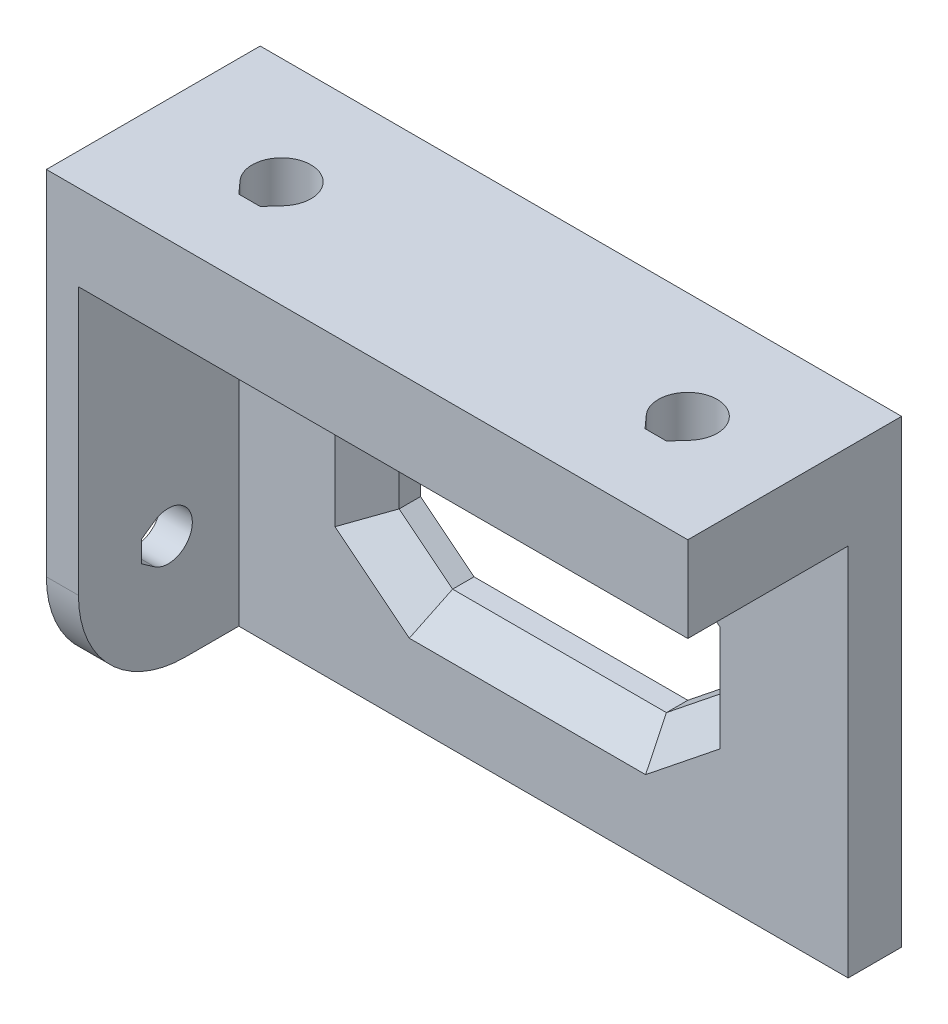
ISO-10303-21;
HEADER;
FILE_DESCRIPTION(('STEP AP214'),'2;1');
FILE_NAME('part.step','',(''),(''),'','','');
FILE_SCHEMA(('AUTOMOTIVE_DESIGN { 1 0 10303 214 1 1 1 1 }'));
ENDSEC;
DATA;
#1=APPLICATION_CONTEXT('core data for automotive mechanical design processes');
#2=APPLICATION_PROTOCOL_DEFINITION('international standard','automotive_design',2000,#1);
#3=PRODUCT_CONTEXT('',#1,'mechanical');
#4=PRODUCT('Part','Part','',(#3));
#5=PRODUCT_RELATED_PRODUCT_CATEGORY('part','',(#4));
#6=PRODUCT_DEFINITION_FORMATION('','',#4);
#7=PRODUCT_DEFINITION_CONTEXT('part definition',#1,'design');
#8=PRODUCT_DEFINITION('design','',#6,#7);
#9=PRODUCT_DEFINITION_SHAPE('','',#8);
#10=(LENGTH_UNIT() NAMED_UNIT(*) SI_UNIT(.MILLI.,.METRE.));
#11=(NAMED_UNIT(*) PLANE_ANGLE_UNIT() SI_UNIT($,.RADIAN.));
#12=(NAMED_UNIT(*) SI_UNIT($,.STERADIAN.) SOLID_ANGLE_UNIT());
#13=UNCERTAINTY_MEASURE_WITH_UNIT(LENGTH_MEASURE(1.E-05),#10,'distance_accuracy_value','');
#14=(GEOMETRIC_REPRESENTATION_CONTEXT(3) GLOBAL_UNCERTAINTY_ASSIGNED_CONTEXT((#13)) GLOBAL_UNIT_ASSIGNED_CONTEXT((#10,
#11,#12)) REPRESENTATION_CONTEXT('',''));
#15=CARTESIAN_POINT('',(0.,0.,0.));
#16=DIRECTION('',(0.,0.,1.));
#17=DIRECTION('',(1.,0.,0.));
#18=AXIS2_PLACEMENT_3D('',#15,#16,#17);
#19=CARTESIAN_POINT('',(0.,0.,5.));
#20=DIRECTION('',(0.,0.,-1.));
#21=DIRECTION('',(-1.,0.,0.));
#22=AXIS2_PLACEMENT_3D('',#19,#20,#21);
#23=PLANE('',#22);
#24=DIRECTION('',(-1.,0.,0.));
#25=VECTOR('',#24,1.);
#26=CARTESIAN_POINT('',(20.,7.,5.));
#27=LINE('',#26,#25);
#28=CARTESIAN_POINT('',(41.0523431780747,7.,5.));
#29=VERTEX_POINT('',#28);
#30=CARTESIAN_POINT('',(18.9476568219253,7.,5.));
#31=VERTEX_POINT('',#30);
#32=EDGE_CURVE('E584',#29,#31,#27,.T.);
#33=ORIENTED_EDGE('',*,*,#32,.T.);
#34=DIRECTION('',(-0.780868809443029,0.624695047554425,0.));
#35=VECTOR('',#34,1.);
#36=CARTESIAN_POINT('',(10.808841686605,13.5110521082563,5.));
#37=LINE('',#36,#35);
#38=CARTESIAN_POINT('',(12.,12.5581254575403,5.));
#39=VERTEX_POINT('',#38);
#40=EDGE_CURVE('E581',#31,#39,#37,.T.);
#41=ORIENTED_EDGE('',*,*,#40,.T.);
#42=DIRECTION('',(0.,1.,0.));
#43=VECTOR('',#42,1.);
#44=CARTESIAN_POINT('',(12.,21.,5.));
#45=LINE('',#44,#43);
#46=CARTESIAN_POINT('',(12.,22.4418745424597,5.));
#47=VERTEX_POINT('',#46);
#48=EDGE_CURVE('E593',#39,#47,#45,.T.);
#49=ORIENTED_EDGE('',*,*,#48,.T.);
#50=DIRECTION('',(0.78086880944303,0.624695047554425,0.));
#51=VECTOR('',#50,1.);
#52=CARTESIAN_POINT('',(-6.2643290451023,7.83041130637787,5.));
#53=LINE('',#52,#51);
#54=CARTESIAN_POINT('',(18.9476568219254,28.,5.));
#55=VERTEX_POINT('',#54);
#56=EDGE_CURVE('E591',#47,#55,#53,.T.);
#57=ORIENTED_EDGE('',*,*,#56,.T.);
#58=DIRECTION('',(1.,0.,0.));
#59=VECTOR('',#58,1.);
#60=CARTESIAN_POINT('',(40.,28.,5.));
#61=LINE('',#60,#59);
#62=CARTESIAN_POINT('',(41.0523431780747,28.,5.));
#63=VERTEX_POINT('',#62);
#64=EDGE_CURVE('E589',#55,#63,#61,.T.);
#65=ORIENTED_EDGE('',*,*,#64,.T.);
#66=DIRECTION('',(0.78086880944303,-0.624695047554425,0.));
#67=VECTOR('',#66,1.);
#68=CARTESIAN_POINT('',(29.6789631914438,37.0987039893047,5.));
#69=LINE('',#68,#67);
#70=CARTESIAN_POINT('',(48.,22.4418745424597,5.));
#71=VERTEX_POINT('',#70);
#72=EDGE_CURVE('E532',#63,#71,#69,.T.);
#73=ORIENTED_EDGE('',*,*,#72,.T.);
#74=DIRECTION('',(0.,-1.,0.));
#75=VECTOR('',#74,1.);
#76=CARTESIAN_POINT('',(48.,14.,5.));
#77=LINE('',#76,#75);
#78=CARTESIAN_POINT('',(48.,12.5581254575403,5.));
#79=VERTEX_POINT('',#78);
#80=EDGE_CURVE('E570',#71,#79,#77,.T.);
#81=ORIENTED_EDGE('',*,*,#80,.T.);
#82=DIRECTION('',(-0.78086880944303,-0.624695047554425,0.));
#83=VECTOR('',#82,1.);
#84=CARTESIAN_POINT('',(12.6057924597365,-15.7572405746706,5.));
#85=LINE('',#84,#83);
#86=EDGE_CURVE('E567',#79,#29,#85,.T.);
#87=ORIENTED_EDGE('',*,*,#86,.T.);
#88=EDGE_LOOP('',(#33,#41,#49,#57,#65,#73,#81,#87));
#89=FACE_BOUND('',#88,.T.);
#90=DIRECTION('',(0.,1.,0.));
#91=VECTOR('',#90,1.);
#92=CARTESIAN_POINT('',(3.,35.,5.));
#93=LINE('',#92,#91);
#94=CARTESIAN_POINT('',(3.,0.,5.));
#95=VERTEX_POINT('',#94);
#96=CARTESIAN_POINT('',(3.,35.,5.));
#97=VERTEX_POINT('',#96);
#98=EDGE_CURVE('E275',#95,#97,#93,.T.);
#99=ORIENTED_EDGE('',*,*,#98,.F.);
#100=DIRECTION('',(1.,0.,0.));
#101=VECTOR('',#100,1.);
#102=CARTESIAN_POINT('',(0.,0.,5.));
#103=LINE('',#102,#101);
#104=CARTESIAN_POINT('',(60.,0.,5.));
#105=VERTEX_POINT('',#104);
#106=EDGE_CURVE('E387',#95,#105,#103,.T.);
#107=ORIENTED_EDGE('',*,*,#106,.T.);
#108=DIRECTION('',(0.,1.,0.));
#109=VECTOR('',#108,1.);
#110=CARTESIAN_POINT('',(60.,0.,5.));
#111=LINE('',#110,#109);
#112=CARTESIAN_POINT('',(60.,35.,5.));
#113=VERTEX_POINT('',#112);
#114=EDGE_CURVE('E389',#105,#113,#111,.T.);
#115=ORIENTED_EDGE('',*,*,#114,.T.);
#116=DIRECTION('',(-1.,0.,0.));
#117=VECTOR('',#116,1.);
#118=CARTESIAN_POINT('',(0.,35.,5.));
#119=LINE('',#118,#117);
#120=EDGE_CURVE('E395',#113,#97,#119,.T.);
#121=ORIENTED_EDGE('',*,*,#120,.T.);
#122=EDGE_LOOP('',(#99,#107,#115,#121));
#123=FACE_BOUND('',#122,.T.);
#124=ADVANCED_FACE('F32',(#89,#123),#23,.F.);
#125=CARTESIAN_POINT('',(60.,35.,20.));
#126=DIRECTION('',(0.,-1.,0.));
#127=DIRECTION('',(0.,0.,-1.));
#128=AXIS2_PLACEMENT_3D('',#125,#126,#127);
#129=PLANE('',#128);
#130=CARTESIAN_POINT('',(12.,35.,10.));
#131=DIRECTION('',(0.,-1.,0.));
#132=DIRECTION('',(0.,0.,-1.));
#133=AXIS2_PLACEMENT_3D('',#130,#131,#132);
#134=CIRCLE('',#133,2.75);
#135=CARTESIAN_POINT('',(9.95571916283033,35.,11.8394063876101));
#136=VERTEX_POINT('',#135);
#137=CARTESIAN_POINT('',(14.0442808371697,35.,11.8394063876101));
#138=VERTEX_POINT('',#137);
#139=EDGE_CURVE('E309',#136,#138,#134,.T.);
#140=ORIENTED_EDGE('',*,*,#139,.F.);
#141=DIRECTION('',(-0.668875050040038,0.,-0.743374849879882));
#142=VECTOR('',#141,1.);
#143=CARTESIAN_POINT('',(9.95571916283033,35.,11.8394063876101));
#144=LINE('',#143,#142);
#145=CARTESIAN_POINT('',(11.,35.,13.));
#146=VERTEX_POINT('',#145);
#147=EDGE_CURVE('E320',#146,#136,#144,.T.);
#148=ORIENTED_EDGE('',*,*,#147,.F.);
#149=DIRECTION('',(-1.,0.,0.));
#150=VECTOR('',#149,1.);
#151=CARTESIAN_POINT('',(11.,35.,13.));
#152=LINE('',#151,#150);
#153=CARTESIAN_POINT('',(13.,35.,13.));
#154=VERTEX_POINT('',#153);
#155=EDGE_CURVE('E334',#154,#146,#152,.T.);
#156=ORIENTED_EDGE('',*,*,#155,.F.);
#157=DIRECTION('',(-0.668875050040038,0.,0.743374849879882));
#158=VECTOR('',#157,1.);
#159=CARTESIAN_POINT('',(13.,35.,13.));
#160=LINE('',#159,#158);
#161=EDGE_CURVE('E331',#138,#154,#160,.T.);
#162=ORIENTED_EDGE('',*,*,#161,.F.);
#163=EDGE_LOOP('',(#140,#148,#156,#162));
#164=FACE_BOUND('',#163,.T.);
#165=CARTESIAN_POINT('',(50.,35.,10.));
#166=DIRECTION('',(0.,-1.,0.));
#167=DIRECTION('',(0.,0.,-1.));
#168=AXIS2_PLACEMENT_3D('',#165,#166,#167);
#169=CIRCLE('',#168,2.75);
#170=CARTESIAN_POINT('',(47.9557191628303,35.,11.8394063876101));
#171=VERTEX_POINT('',#170);
#172=CARTESIAN_POINT('',(52.0442808371697,35.,11.8394063876101));
#173=VERTEX_POINT('',#172);
#174=EDGE_CURVE('E281',#171,#173,#169,.T.);
#175=ORIENTED_EDGE('',*,*,#174,.F.);
#176=DIRECTION('',(-0.668875050040038,0.,-0.743374849879882));
#177=VECTOR('',#176,1.);
#178=CARTESIAN_POINT('',(47.9557191628303,35.,11.8394063876101));
#179=LINE('',#178,#177);
#180=CARTESIAN_POINT('',(49.,35.,13.));
#181=VERTEX_POINT('',#180);
#182=EDGE_CURVE('E288',#181,#171,#179,.T.);
#183=ORIENTED_EDGE('',*,*,#182,.F.);
#184=DIRECTION('',(-1.,0.,0.));
#185=VECTOR('',#184,1.);
#186=CARTESIAN_POINT('',(49.,35.,13.));
#187=LINE('',#186,#185);
#188=CARTESIAN_POINT('',(51.,35.,13.));
#189=VERTEX_POINT('',#188);
#190=EDGE_CURVE('E302',#189,#181,#187,.T.);
#191=ORIENTED_EDGE('',*,*,#190,.F.);
#192=DIRECTION('',(-0.668875050040038,0.,0.743374849879881));
#193=VECTOR('',#192,1.);
#194=CARTESIAN_POINT('',(51.,35.,13.));
#195=LINE('',#194,#193);
#196=EDGE_CURVE('E299',#173,#189,#195,.T.);
#197=ORIENTED_EDGE('',*,*,#196,.F.);
#198=EDGE_LOOP('',(#175,#183,#191,#197));
#199=FACE_BOUND('',#198,.T.);
#200=DIRECTION('',(-1.,0.,0.));
#201=VECTOR('',#200,1.);
#202=CARTESIAN_POINT('',(60.,35.,20.));
#203=LINE('',#202,#201);
#204=CARTESIAN_POINT('',(60.,35.,20.));
#205=VERTEX_POINT('',#204);
#206=CARTESIAN_POINT('',(3.,35.,20.));
#207=VERTEX_POINT('',#206);
#208=EDGE_CURVE('E351',#205,#207,#203,.T.);
#209=ORIENTED_EDGE('',*,*,#208,.T.);
#210=DIRECTION('',(0.,0.,-1.));
#211=VECTOR('',#210,1.);
#212=CARTESIAN_POINT('',(3.,35.,55.1283361405006));
#213=LINE('',#212,#211);
#214=EDGE_CURVE('E278',#207,#97,#213,.T.);
#215=ORIENTED_EDGE('',*,*,#214,.T.);
#216=ORIENTED_EDGE('',*,*,#120,.F.);
#217=DIRECTION('',(0.,0.,-1.));
#218=VECTOR('',#217,1.);
#219=CARTESIAN_POINT('',(60.,35.,20.));
#220=LINE('',#219,#218);
#221=EDGE_CURVE('E359',#205,#113,#220,.T.);
#222=ORIENTED_EDGE('',*,*,#221,.F.);
#223=EDGE_LOOP('',(#209,#215,#216,#222));
#224=FACE_BOUND('',#223,.T.);
#225=ADVANCED_FACE('F430',(#164,#199,#224),#129,.T.);
#226=CARTESIAN_POINT('',(0.,0.,0.));
#227=DIRECTION('',(0.,0.,-1.));
#228=DIRECTION('',(-1.,0.,0.));
#229=AXIS2_PLACEMENT_3D('',#226,#227,#228);
#230=PLANE('',#229);
#231=DIRECTION('',(0.,-1.,0.));
#232=VECTOR('',#231,1.);
#233=CARTESIAN_POINT('',(0.,0.,0.));
#234=LINE('',#233,#232);
#235=CARTESIAN_POINT('',(0.,43.,0.));
#236=VERTEX_POINT('',#235);
#237=CARTESIAN_POINT('',(0.,0.,0.));
#238=VERTEX_POINT('',#237);
#239=EDGE_CURVE('E386',#236,#238,#234,.T.);
#240=ORIENTED_EDGE('',*,*,#239,.F.);
#241=DIRECTION('',(1.,0.,0.));
#242=VECTOR('',#241,1.);
#243=CARTESIAN_POINT('',(60.,43.,0.));
#244=LINE('',#243,#242);
#245=CARTESIAN_POINT('',(60.,43.,0.));
#246=VERTEX_POINT('',#245);
#247=EDGE_CURVE('E341',#236,#246,#244,.T.);
#248=ORIENTED_EDGE('',*,*,#247,.T.);
#249=DIRECTION('',(0.,1.,0.));
#250=VECTOR('',#249,1.);
#251=CARTESIAN_POINT('',(60.,0.,0.));
#252=LINE('',#251,#250);
#253=CARTESIAN_POINT('',(60.,0.,0.));
#254=VERTEX_POINT('',#253);
#255=EDGE_CURVE('E390',#254,#246,#252,.T.);
#256=ORIENTED_EDGE('',*,*,#255,.F.);
#257=DIRECTION('',(1.,0.,0.));
#258=VECTOR('',#257,1.);
#259=CARTESIAN_POINT('',(0.,0.,0.));
#260=LINE('',#259,#258);
#261=EDGE_CURVE('E623',#238,#254,#260,.T.);
#262=ORIENTED_EDGE('',*,*,#261,.F.);
#263=EDGE_LOOP('',(#240,#248,#256,#262));
#264=FACE_BOUND('',#263,.T.);
#265=DIRECTION('',(0.,1.,0.));
#266=VECTOR('',#265,1.);
#267=CARTESIAN_POINT('',(45.,25.,0.));
#268=LINE('',#267,#266);
#269=CARTESIAN_POINT('',(45.,14.,0.));
#270=VERTEX_POINT('',#269);
#271=CARTESIAN_POINT('',(45.,21.,0.));
#272=VERTEX_POINT('',#271);
#273=EDGE_CURVE('E380',#270,#272,#268,.T.);
#274=ORIENTED_EDGE('',*,*,#273,.T.);
#275=DIRECTION('',(0.78086880944303,-0.624695047554425,0.));
#276=VECTOR('',#275,1.);
#277=CARTESIAN_POINT('',(45.,21.,0.));
#278=LINE('',#277,#276);
#279=CARTESIAN_POINT('',(40.,25.,0.));
#280=VERTEX_POINT('',#279);
#281=EDGE_CURVE('E597',#272,#280,#278,.F.);
#282=ORIENTED_EDGE('',*,*,#281,.T.);
#283=DIRECTION('',(-1.,0.,0.));
#284=VECTOR('',#283,1.);
#285=CARTESIAN_POINT('',(15.,25.,0.));
#286=LINE('',#285,#284);
#287=CARTESIAN_POINT('',(20.,25.,0.));
#288=VERTEX_POINT('',#287);
#289=EDGE_CURVE('E383',#280,#288,#286,.T.);
#290=ORIENTED_EDGE('',*,*,#289,.T.);
#291=DIRECTION('',(0.78086880944303,0.624695047554425,0.));
#292=VECTOR('',#291,1.);
#293=CARTESIAN_POINT('',(20.,25.,0.));
#294=LINE('',#293,#292);
#295=CARTESIAN_POINT('',(15.,21.,0.));
#296=VERTEX_POINT('',#295);
#297=EDGE_CURVE('E608',#288,#296,#294,.F.);
#298=ORIENTED_EDGE('',*,*,#297,.T.);
#299=DIRECTION('',(0.,-1.,0.));
#300=VECTOR('',#299,1.);
#301=CARTESIAN_POINT('',(15.,25.,0.));
#302=LINE('',#301,#300);
#303=CARTESIAN_POINT('',(15.,14.,0.));
#304=VERTEX_POINT('',#303);
#305=EDGE_CURVE('E373',#296,#304,#302,.T.);
#306=ORIENTED_EDGE('',*,*,#305,.T.);
#307=DIRECTION('',(-0.780868809443029,0.624695047554425,0.));
#308=VECTOR('',#307,1.);
#309=CARTESIAN_POINT('',(15.,14.,0.));
#310=LINE('',#309,#308);
#311=CARTESIAN_POINT('',(20.,10.,0.));
#312=VERTEX_POINT('',#311);
#313=EDGE_CURVE('E595',#304,#312,#310,.F.);
#314=ORIENTED_EDGE('',*,*,#313,.T.);
#315=DIRECTION('',(1.,0.,0.));
#316=VECTOR('',#315,1.);
#317=CARTESIAN_POINT('',(15.,10.,0.));
#318=LINE('',#317,#316);
#319=CARTESIAN_POINT('',(40.,10.,0.));
#320=VERTEX_POINT('',#319);
#321=EDGE_CURVE('E376',#312,#320,#318,.T.);
#322=ORIENTED_EDGE('',*,*,#321,.T.);
#323=DIRECTION('',(-0.78086880944303,-0.624695047554425,0.));
#324=VECTOR('',#323,1.);
#325=CARTESIAN_POINT('',(40.,10.,0.));
#326=LINE('',#325,#324);
#327=EDGE_CURVE('E610',#320,#270,#326,.F.);
#328=ORIENTED_EDGE('',*,*,#327,.T.);
#329=EDGE_LOOP('',(#274,#282,#290,#298,#306,#314,#322,#328));
#330=FACE_BOUND('',#329,.T.);
#331=ADVANCED_FACE('F457',(#264,#330),#230,.T.);
#332=CARTESIAN_POINT('',(0.,0.,5.));
#333=DIRECTION('',(1.,0.,0.));
#334=DIRECTION('',(0.,0.,-1.));
#335=AXIS2_PLACEMENT_3D('',#332,#333,#334);
#336=PLANE('',#335);
#337=DIRECTION('',(0.,0.571859317824151,0.820351705439622));
#338=VECTOR('',#337,1.);
#339=CARTESIAN_POINT('',(0.,9.6,14.1));
#340=LINE('',#339,#338);
#341=CARTESIAN_POINT('',(0.,8.75420866276086,12.8866834651043));
#342=VERTEX_POINT('',#341);
#343=CARTESIAN_POINT('',(0.,9.6,14.1));
#344=VERTEX_POINT('',#343);
#345=EDGE_CURVE('E255',#342,#344,#340,.T.);
#346=ORIENTED_EDGE('',*,*,#345,.F.);
#347=CARTESIAN_POINT('',(0.,10.6,11.6));
#348=DIRECTION('',(-1.,0.,0.));
#349=DIRECTION('',(0.,0.,1.));
#350=AXIS2_PLACEMENT_3D('',#347,#348,#349);
#351=CIRCLE('',#350,2.25);
#352=CARTESIAN_POINT('',(0.,12.4457913372392,12.8866834651043));
#353=VERTEX_POINT('',#352);
#354=EDGE_CURVE('E260',#353,#342,#351,.T.);
#355=ORIENTED_EDGE('',*,*,#354,.F.);
#356=DIRECTION('',(0.,0.571859317824151,-0.820351705439622));
#357=VECTOR('',#356,1.);
#358=CARTESIAN_POINT('',(0.,12.4457913372392,12.8866834651043));
#359=LINE('',#358,#357);
#360=CARTESIAN_POINT('',(0.,11.6,14.1));
#361=VERTEX_POINT('',#360);
#362=EDGE_CURVE('E265',#361,#353,#359,.T.);
#363=ORIENTED_EDGE('',*,*,#362,.F.);
#364=DIRECTION('',(0.,1.,0.));
#365=VECTOR('',#364,1.);
#366=CARTESIAN_POINT('',(0.,11.6,14.1));
#367=LINE('',#366,#365);
#368=EDGE_CURVE('E244',#344,#361,#367,.T.);
#369=ORIENTED_EDGE('',*,*,#368,.F.);
#370=EDGE_LOOP('',(#346,#355,#363,#369));
#371=FACE_BOUND('',#370,.T.);
#372=DIRECTION('',(0.,0.,-1.));
#373=VECTOR('',#372,1.);
#374=CARTESIAN_POINT('',(0.,0.,5.));
#375=LINE('',#374,#373);
#376=CARTESIAN_POINT('',(0.,0.,10.));
#377=VERTEX_POINT('',#376);
#378=EDGE_CURVE('E445',#377,#238,#375,.T.);
#379=ORIENTED_EDGE('',*,*,#378,.F.);
#380=CARTESIAN_POINT('',(0.,10.,10.));
#381=DIRECTION('',(1.,0.,0.));
#382=DIRECTION('',(0.,0.,-1.));
#383=AXIS2_PLACEMENT_3D('',#380,#381,#382);
#384=CIRCLE('',#383,10.);
#385=CARTESIAN_POINT('',(0.,10.,20.));
#386=VERTEX_POINT('',#385);
#387=EDGE_CURVE('E11',#377,#386,#384,.F.);
#388=ORIENTED_EDGE('',*,*,#387,.T.);
#389=DIRECTION('',(0.,1.,0.));
#390=VECTOR('',#389,1.);
#391=CARTESIAN_POINT('',(0.,35.,20.));
#392=LINE('',#391,#390);
#393=CARTESIAN_POINT('',(0.,43.,20.));
#394=VERTEX_POINT('',#393);
#395=EDGE_CURVE('E354',#386,#394,#392,.T.);
#396=ORIENTED_EDGE('',*,*,#395,.T.);
#397=DIRECTION('',(0.,0.,-1.));
#398=VECTOR('',#397,1.);
#399=CARTESIAN_POINT('',(0.,43.,20.));
#400=LINE('',#399,#398);
#401=EDGE_CURVE('E366',#394,#236,#400,.T.);
#402=ORIENTED_EDGE('',*,*,#401,.T.);
#403=ORIENTED_EDGE('',*,*,#239,.T.);
#404=EDGE_LOOP('',(#379,#388,#396,#402,#403));
#405=FACE_BOUND('',#404,.T.);
#406=ADVANCED_FACE('F262',(#371,#405),#336,.F.);
#407=CARTESIAN_POINT('',(0.,0.,5.));
#408=DIRECTION('',(0.,1.,0.));
#409=DIRECTION('',(0.,0.,1.));
#410=AXIS2_PLACEMENT_3D('',#407,#408,#409);
#411=PLANE('',#410);
#412=DIRECTION('',(0.,0.,-1.));
#413=VECTOR('',#412,1.);
#414=CARTESIAN_POINT('',(3.,0.,55.1283361405006));
#415=LINE('',#414,#413);
#416=CARTESIAN_POINT('',(3.,0.,10.));
#417=VERTEX_POINT('',#416);
#418=EDGE_CURVE('E272',#417,#95,#415,.T.);
#419=ORIENTED_EDGE('',*,*,#418,.F.);
#420=DIRECTION('',(1.,0.,0.));
#421=VECTOR('',#420,1.);
#422=CARTESIAN_POINT('',(0.,0.,10.));
#423=LINE('',#422,#421);
#424=EDGE_CURVE('E40',#417,#377,#423,.F.);
#425=ORIENTED_EDGE('',*,*,#424,.T.);
#426=ORIENTED_EDGE('',*,*,#378,.T.);
#427=ORIENTED_EDGE('',*,*,#261,.T.);
#428=DIRECTION('',(0.,0.,-1.));
#429=VECTOR('',#428,1.);
#430=CARTESIAN_POINT('',(60.,0.,5.));
#431=LINE('',#430,#429);
#432=EDGE_CURVE('E399',#105,#254,#431,.T.);
#433=ORIENTED_EDGE('',*,*,#432,.F.);
#434=ORIENTED_EDGE('',*,*,#106,.F.);
#435=EDGE_LOOP('',(#419,#425,#426,#427,#433,#434));
#436=FACE_BOUND('',#435,.T.);
#437=ADVANCED_FACE('F469',(#436),#411,.F.);
#438=CARTESIAN_POINT('',(60.,0.,5.));
#439=DIRECTION('',(-1.,0.,0.));
#440=DIRECTION('',(0.,0.,1.));
#441=AXIS2_PLACEMENT_3D('',#438,#439,#440);
#442=PLANE('',#441);
#443=ORIENTED_EDGE('',*,*,#255,.T.);
#444=DIRECTION('',(0.,0.,-1.));
#445=VECTOR('',#444,1.);
#446=CARTESIAN_POINT('',(60.,43.,20.));
#447=LINE('',#446,#445);
#448=CARTESIAN_POINT('',(60.,43.,20.));
#449=VERTEX_POINT('',#448);
#450=EDGE_CURVE('E362',#449,#246,#447,.T.);
#451=ORIENTED_EDGE('',*,*,#450,.F.);
#452=DIRECTION('',(0.,-1.,0.));
#453=VECTOR('',#452,1.);
#454=CARTESIAN_POINT('',(60.,35.,20.));
#455=LINE('',#454,#453);
#456=EDGE_CURVE('E348',#449,#205,#455,.T.);
#457=ORIENTED_EDGE('',*,*,#456,.T.);
#458=ORIENTED_EDGE('',*,*,#221,.T.);
#459=ORIENTED_EDGE('',*,*,#114,.F.);
#460=ORIENTED_EDGE('',*,*,#432,.T.);
#461=EDGE_LOOP('',(#443,#451,#457,#458,#459,#460));
#462=FACE_BOUND('',#461,.T.);
#463=ADVANCED_FACE('F437',(#462),#442,.F.);
#464=CARTESIAN_POINT('',(15.,25.,5.));
#465=DIRECTION('',(1.,0.,0.));
#466=DIRECTION('',(0.,1.,0.));
#467=AXIS2_PLACEMENT_3D('',#464,#465,#466);
#468=PLANE('',#467);
#469=DIRECTION('',(0.,0.,1.));
#470=VECTOR('',#469,1.);
#471=CARTESIAN_POINT('',(15.,21.,5.));
#472=LINE('',#471,#470);
#473=CARTESIAN_POINT('',(15.,21.,2.));
#474=VERTEX_POINT('',#473);
#475=EDGE_CURVE('E612',#296,#474,#472,.T.);
#476=ORIENTED_EDGE('',*,*,#475,.T.);
#477=DIRECTION('',(0.,-1.,0.));
#478=VECTOR('',#477,1.);
#479=CARTESIAN_POINT('',(15.,14.,2.));
#480=LINE('',#479,#478);
#481=CARTESIAN_POINT('',(15.,14.,2.));
#482=VERTEX_POINT('',#481);
#483=EDGE_CURVE('E407',#474,#482,#480,.T.);
#484=ORIENTED_EDGE('',*,*,#483,.T.);
#485=DIRECTION('',(0.,0.,-1.));
#486=VECTOR('',#485,1.);
#487=CARTESIAN_POINT('',(15.,14.,0.));
#488=LINE('',#487,#486);
#489=EDGE_CURVE('E602',#482,#304,#488,.T.);
#490=ORIENTED_EDGE('',*,*,#489,.T.);
#491=ORIENTED_EDGE('',*,*,#305,.F.);
#492=EDGE_LOOP('',(#476,#484,#490,#491));
#493=FACE_BOUND('',#492,.T.);
#494=ADVANCED_FACE('F462',(#493),#468,.T.);
#495=CARTESIAN_POINT('',(15.,10.,5.));
#496=DIRECTION('',(0.,1.,0.));
#497=DIRECTION('',(-1.,0.,0.));
#498=AXIS2_PLACEMENT_3D('',#495,#496,#497);
#499=PLANE('',#498);
#500=DIRECTION('',(0.,0.,1.));
#501=VECTOR('',#500,1.);
#502=CARTESIAN_POINT('',(20.,10.,5.));
#503=LINE('',#502,#501);
#504=CARTESIAN_POINT('',(20.,10.,2.));
#505=VERTEX_POINT('',#504);
#506=EDGE_CURVE('E599',#312,#505,#503,.T.);
#507=ORIENTED_EDGE('',*,*,#506,.T.);
#508=DIRECTION('',(1.,0.,0.));
#509=VECTOR('',#508,1.);
#510=CARTESIAN_POINT('',(40.,10.,2.));
#511=LINE('',#510,#509);
#512=CARTESIAN_POINT('',(40.,10.,2.));
#513=VERTEX_POINT('',#512);
#514=EDGE_CURVE('E574',#505,#513,#511,.T.);
#515=ORIENTED_EDGE('',*,*,#514,.T.);
#516=DIRECTION('',(0.,0.,-1.));
#517=VECTOR('',#516,1.);
#518=CARTESIAN_POINT('',(40.,10.,0.));
#519=LINE('',#518,#517);
#520=EDGE_CURVE('E619',#513,#320,#519,.T.);
#521=ORIENTED_EDGE('',*,*,#520,.T.);
#522=ORIENTED_EDGE('',*,*,#321,.F.);
#523=EDGE_LOOP('',(#507,#515,#521,#522));
#524=FACE_BOUND('',#523,.T.);
#525=ADVANCED_FACE('F635',(#524),#499,.T.);
#526=CARTESIAN_POINT('',(45.,25.,5.));
#527=DIRECTION('',(-1.,0.,0.));
#528=DIRECTION('',(0.,-1.,0.));
#529=AXIS2_PLACEMENT_3D('',#526,#527,#528);
#530=PLANE('',#529);
#531=DIRECTION('',(0.,0.,1.));
#532=VECTOR('',#531,1.);
#533=CARTESIAN_POINT('',(45.,14.,5.));
#534=LINE('',#533,#532);
#535=CARTESIAN_POINT('',(45.,14.,2.));
#536=VERTEX_POINT('',#535);
#537=EDGE_CURVE('E617',#270,#536,#534,.T.);
#538=ORIENTED_EDGE('',*,*,#537,.T.);
#539=DIRECTION('',(0.,1.,0.));
#540=VECTOR('',#539,1.);
#541=CARTESIAN_POINT('',(45.,21.,2.));
#542=LINE('',#541,#540);
#543=CARTESIAN_POINT('',(45.,21.,2.));
#544=VERTEX_POINT('',#543);
#545=EDGE_CURVE('E546',#536,#544,#542,.T.);
#546=ORIENTED_EDGE('',*,*,#545,.T.);
#547=DIRECTION('',(0.,0.,-1.));
#548=VECTOR('',#547,1.);
#549=CARTESIAN_POINT('',(45.,21.,0.));
#550=LINE('',#549,#548);
#551=EDGE_CURVE('E606',#544,#272,#550,.T.);
#552=ORIENTED_EDGE('',*,*,#551,.T.);
#553=ORIENTED_EDGE('',*,*,#273,.F.);
#554=EDGE_LOOP('',(#538,#546,#552,#553));
#555=FACE_BOUND('',#554,.T.);
#556=ADVANCED_FACE('F631',(#555),#530,.T.);
#557=CARTESIAN_POINT('',(15.,25.,5.));
#558=DIRECTION('',(0.,-1.,0.));
#559=DIRECTION('',(0.,0.,-1.));
#560=AXIS2_PLACEMENT_3D('',#557,#558,#559);
#561=PLANE('',#560);
#562=DIRECTION('',(0.,0.,1.));
#563=VECTOR('',#562,1.);
#564=CARTESIAN_POINT('',(40.,25.,5.));
#565=LINE('',#564,#563);
#566=CARTESIAN_POINT('',(40.,25.,2.));
#567=VERTEX_POINT('',#566);
#568=EDGE_CURVE('E604',#280,#567,#565,.T.);
#569=ORIENTED_EDGE('',*,*,#568,.T.);
#570=DIRECTION('',(-1.,0.,0.));
#571=VECTOR('',#570,1.);
#572=CARTESIAN_POINT('',(20.,25.,2.));
#573=LINE('',#572,#571);
#574=CARTESIAN_POINT('',(20.,25.,2.));
#575=VERTEX_POINT('',#574);
#576=EDGE_CURVE('E536',#567,#575,#573,.T.);
#577=ORIENTED_EDGE('',*,*,#576,.T.);
#578=DIRECTION('',(0.,0.,-1.));
#579=VECTOR('',#578,1.);
#580=CARTESIAN_POINT('',(20.,25.,0.));
#581=LINE('',#580,#579);
#582=EDGE_CURVE('E615',#575,#288,#581,.T.);
#583=ORIENTED_EDGE('',*,*,#582,.T.);
#584=ORIENTED_EDGE('',*,*,#289,.F.);
#585=EDGE_LOOP('',(#569,#577,#583,#584));
#586=FACE_BOUND('',#585,.T.);
#587=ADVANCED_FACE('F478',(#586),#561,.T.);
#588=CARTESIAN_POINT('',(40.,10.,5.));
#589=DIRECTION('',(-0.624695047554425,0.78086880944303,0.));
#590=DIRECTION('',(0.,0.,1.));
#591=AXIS2_PLACEMENT_3D('',#588,#589,#590);
#592=PLANE('',#591);
#593=ORIENTED_EDGE('',*,*,#520,.F.);
#594=DIRECTION('',(-0.78086880944303,-0.624695047554425,0.));
#595=VECTOR('',#594,1.);
#596=CARTESIAN_POINT('',(40.,10.,2.));
#597=LINE('',#596,#595);
#598=EDGE_CURVE('E566',#513,#536,#597,.F.);
#599=ORIENTED_EDGE('',*,*,#598,.T.);
#600=ORIENTED_EDGE('',*,*,#537,.F.);
#601=ORIENTED_EDGE('',*,*,#327,.F.);
#602=EDGE_LOOP('',(#593,#599,#600,#601));
#603=FACE_BOUND('',#602,.T.);
#604=ADVANCED_FACE('F474',(#603),#592,.T.);
#605=CARTESIAN_POINT('',(20.,25.,5.));
#606=DIRECTION('',(0.624695047554425,-0.78086880944303,0.));
#607=DIRECTION('',(0.,0.,1.));
#608=AXIS2_PLACEMENT_3D('',#605,#606,#607);
#609=PLANE('',#608);
#610=ORIENTED_EDGE('',*,*,#582,.F.);
#611=DIRECTION('',(0.78086880944303,0.624695047554425,0.));
#612=VECTOR('',#611,1.);
#613=CARTESIAN_POINT('',(20.,25.,2.));
#614=LINE('',#613,#612);
#615=EDGE_CURVE('E543',#575,#474,#614,.F.);
#616=ORIENTED_EDGE('',*,*,#615,.T.);
#617=ORIENTED_EDGE('',*,*,#475,.F.);
#618=ORIENTED_EDGE('',*,*,#297,.F.);
#619=EDGE_LOOP('',(#610,#616,#617,#618));
#620=FACE_BOUND('',#619,.T.);
#621=ADVANCED_FACE('F477',(#620),#609,.T.);
#622=CARTESIAN_POINT('',(45.,21.,5.));
#623=DIRECTION('',(-0.624695047554425,-0.78086880944303,0.));
#624=DIRECTION('',(0.,0.,1.));
#625=AXIS2_PLACEMENT_3D('',#622,#623,#624);
#626=PLANE('',#625);
#627=ORIENTED_EDGE('',*,*,#551,.F.);
#628=DIRECTION('',(0.78086880944303,-0.624695047554425,0.));
#629=VECTOR('',#628,1.);
#630=CARTESIAN_POINT('',(45.,21.,2.));
#631=LINE('',#630,#629);
#632=EDGE_CURVE('E530',#544,#567,#631,.F.);
#633=ORIENTED_EDGE('',*,*,#632,.T.);
#634=ORIENTED_EDGE('',*,*,#568,.F.);
#635=ORIENTED_EDGE('',*,*,#281,.F.);
#636=EDGE_LOOP('',(#627,#633,#634,#635));
#637=FACE_BOUND('',#636,.T.);
#638=ADVANCED_FACE('F482',(#637),#626,.T.);
#639=CARTESIAN_POINT('',(15.,14.,5.));
#640=DIRECTION('',(0.624695047554425,0.780868809443029,0.));
#641=DIRECTION('',(0.,0.,1.));
#642=AXIS2_PLACEMENT_3D('',#639,#640,#641);
#643=PLANE('',#642);
#644=ORIENTED_EDGE('',*,*,#489,.F.);
#645=DIRECTION('',(-0.780868809443029,0.624695047554425,0.));
#646=VECTOR('',#645,1.);
#647=CARTESIAN_POINT('',(15.,14.,2.));
#648=LINE('',#647,#646);
#649=EDGE_CURVE('E578',#482,#505,#648,.F.);
#650=ORIENTED_EDGE('',*,*,#649,.T.);
#651=ORIENTED_EDGE('',*,*,#506,.F.);
#652=ORIENTED_EDGE('',*,*,#313,.F.);
#653=EDGE_LOOP('',(#644,#650,#651,#652));
#654=FACE_BOUND('',#653,.T.);
#655=ADVANCED_FACE('F486',(#654),#643,.T.);
#656=CARTESIAN_POINT('',(29.6789631914438,37.0987039893047,5.));
#657=DIRECTION('',(-0.441726104299386,-0.552157630374231,0.707106781186549));
#658=DIRECTION('',(-0.78086880944303,0.624695047554425,0.));
#659=AXIS2_PLACEMENT_3D('',#656,#657,#658);
#660=PLANE('',#659);
#661=DIRECTION('',(0.240744456161528,0.686309735770772,0.68630973577077));
#662=VECTOR('',#661,1.);
#663=CARTESIAN_POINT('',(41.8965018053679,30.4065114257813,7.40651142578126));
#664=LINE('',#663,#662);
#665=EDGE_CURVE('E527',#567,#63,#664,.T.);
#666=ORIENTED_EDGE('',*,*,#665,.F.);
#667=ORIENTED_EDGE('',*,*,#632,.F.);
#668=DIRECTION('',(0.669499398412277,0.321778046254249,0.669499398412274));
#669=VECTOR('',#668,1.);
#670=CARTESIAN_POINT('',(45.861720833558,21.4141644442048,2.86172083355799));
#671=LINE('',#670,#669);
#672=EDGE_CURVE('E377',#71,#544,#671,.F.);
#673=ORIENTED_EDGE('',*,*,#672,.F.);
#674=ORIENTED_EDGE('',*,*,#72,.F.);
#675=EDGE_LOOP('',(#666,#667,#673,#674));
#676=FACE_BOUND('',#675,.T.);
#677=ADVANCED_FACE('F490',(#676),#660,.T.);
#678=CARTESIAN_POINT('',(45.,25.,2.));
#679=DIRECTION('',(-0.707106781186546,0.,0.707106781186549));
#680=DIRECTION('',(0.,-1.,0.));
#681=AXIS2_PLACEMENT_3D('',#678,#679,#680);
#682=PLANE('',#681);
#683=ORIENTED_EDGE('',*,*,#672,.T.);
#684=ORIENTED_EDGE('',*,*,#545,.F.);
#685=DIRECTION('',(0.669499398412278,-0.321778046254247,0.669499398412274));
#686=VECTOR('',#685,1.);
#687=CARTESIAN_POINT('',(38.23525922156,17.2513025049238,-4.76474077843991));
#688=LINE('',#687,#686);
#689=EDGE_CURVE('E534',#79,#536,#688,.F.);
#690=ORIENTED_EDGE('',*,*,#689,.F.);
#691=ORIENTED_EDGE('',*,*,#80,.F.);
#692=EDGE_LOOP('',(#683,#684,#690,#691));
#693=FACE_BOUND('',#692,.T.);
#694=ADVANCED_FACE('F515',(#693),#682,.T.);
#695=CARTESIAN_POINT('',(15.,25.,2.));
#696=DIRECTION('',(0.,-0.707106781186547,0.707106781186548));
#697=DIRECTION('',(1.,0.,0.));
#698=AXIS2_PLACEMENT_3D('',#695,#696,#697);
#699=PLANE('',#698);
#700=ORIENTED_EDGE('',*,*,#665,.T.);
#701=ORIENTED_EDGE('',*,*,#64,.F.);
#702=DIRECTION('',(-0.240744456161525,0.686309735770772,0.68630973577077));
#703=VECTOR('',#702,1.);
#704=CARTESIAN_POINT('',(19.7102105341374,25.8261263204825,2.82612632048247));
#705=LINE('',#704,#703);
#706=EDGE_CURVE('E538',#575,#55,#705,.T.);
#707=ORIENTED_EDGE('',*,*,#706,.F.);
#708=ORIENTED_EDGE('',*,*,#576,.F.);
#709=EDGE_LOOP('',(#700,#701,#707,#708));
#710=FACE_BOUND('',#709,.T.);
#711=ADVANCED_FACE('F511',(#710),#699,.T.);
#712=CARTESIAN_POINT('',(12.6057924597365,-15.7572405746706,5.));
#713=DIRECTION('',(-0.441726104299386,0.552157630374232,0.707106781186548));
#714=DIRECTION('',(0.78086880944303,0.624695047554425,0.));
#715=AXIS2_PLACEMENT_3D('',#712,#713,#714);
#716=PLANE('',#715);
#717=ORIENTED_EDGE('',*,*,#689,.T.);
#718=ORIENTED_EDGE('',*,*,#598,.F.);
#719=DIRECTION('',(0.240744456161525,-0.686309735770772,0.68630973577077));
#720=VECTOR('',#719,1.);
#721=CARTESIAN_POINT('',(38.5510526706873,14.1306316024124,-2.13063160241235));
#722=LINE('',#721,#720);
#723=EDGE_CURVE('E557',#29,#513,#722,.F.);
#724=ORIENTED_EDGE('',*,*,#723,.F.);
#725=ORIENTED_EDGE('',*,*,#86,.F.);
#726=EDGE_LOOP('',(#717,#718,#724,#725));
#727=FACE_BOUND('',#726,.T.);
#728=ADVANCED_FACE('F507',(#727),#716,.T.);
#729=CARTESIAN_POINT('',(-6.2643290451023,7.83041130637786,5.));
#730=DIRECTION('',(0.441726104299386,-0.552157630374232,0.707106781186548));
#731=DIRECTION('',(-0.78086880944303,-0.624695047554425,0.));
#732=AXIS2_PLACEMENT_3D('',#729,#730,#731);
#733=PLANE('',#732);
#734=ORIENTED_EDGE('',*,*,#706,.T.);
#735=ORIENTED_EDGE('',*,*,#56,.F.);
#736=DIRECTION('',(-0.669499398412276,0.321778046254249,0.669499398412275));
#737=VECTOR('',#736,1.);
#738=CARTESIAN_POINT('',(6.96114050824074,24.8636756171928,10.0388594917592));
#739=LINE('',#738,#737);
#740=EDGE_CURVE('E554',#474,#47,#739,.T.);
#741=ORIENTED_EDGE('',*,*,#740,.F.);
#742=ORIENTED_EDGE('',*,*,#615,.F.);
#743=EDGE_LOOP('',(#734,#735,#741,#742));
#744=FACE_BOUND('',#743,.T.);
#745=ADVANCED_FACE('F503',(#744),#733,.T.);
#746=CARTESIAN_POINT('',(15.,10.,2.));
#747=DIRECTION('',(0.,0.707106781186547,0.707106781186548));
#748=DIRECTION('',(-1.,0.,0.));
#749=AXIS2_PLACEMENT_3D('',#746,#747,#748);
#750=PLANE('',#749);
#751=ORIENTED_EDGE('',*,*,#723,.T.);
#752=ORIENTED_EDGE('',*,*,#514,.F.);
#753=DIRECTION('',(-0.240744456161526,-0.686309735770772,0.68630973577077));
#754=VECTOR('',#753,1.);
#755=CARTESIAN_POINT('',(19.5517385478943,8.72210474269681,3.27789525730319));
#756=LINE('',#755,#754);
#757=EDGE_CURVE('E552',#31,#505,#756,.F.);
#758=ORIENTED_EDGE('',*,*,#757,.F.);
#759=ORIENTED_EDGE('',*,*,#32,.F.);
#760=EDGE_LOOP('',(#751,#752,#758,#759));
#761=FACE_BOUND('',#760,.T.);
#762=ADVANCED_FACE('F499',(#761),#750,.T.);
#763=CARTESIAN_POINT('',(15.,25.,2.));
#764=DIRECTION('',(0.707106781186547,0.,0.707106781186548));
#765=DIRECTION('',(0.,1.,0.));
#766=AXIS2_PLACEMENT_3D('',#763,#764,#765);
#767=PLANE('',#766);
#768=ORIENTED_EDGE('',*,*,#740,.T.);
#769=ORIENTED_EDGE('',*,*,#48,.F.);
#770=DIRECTION('',(0.669499398412276,0.321778046254249,-0.669499398412275));
#771=VECTOR('',#770,1.);
#772=CARTESIAN_POINT('',(11.6713769578496,12.4001810580262,5.32862304215044));
#773=LINE('',#772,#771);
#774=EDGE_CURVE('E365',#482,#39,#773,.F.);
#775=ORIENTED_EDGE('',*,*,#774,.F.);
#776=ORIENTED_EDGE('',*,*,#483,.F.);
#777=EDGE_LOOP('',(#768,#769,#775,#776));
#778=FACE_BOUND('',#777,.T.);
#779=ADVANCED_FACE('F495',(#778),#767,.T.);
#780=CARTESIAN_POINT('',(10.808841686605,13.5110521082563,5.));
#781=DIRECTION('',(0.441726104299387,0.552157630374232,0.707106781186548));
#782=DIRECTION('',(0.780868809443029,-0.624695047554425,0.));
#783=AXIS2_PLACEMENT_3D('',#780,#781,#782);
#784=PLANE('',#783);
#785=ORIENTED_EDGE('',*,*,#757,.T.);
#786=ORIENTED_EDGE('',*,*,#649,.F.);
#787=ORIENTED_EDGE('',*,*,#774,.T.);
#788=ORIENTED_EDGE('',*,*,#40,.F.);
#789=EDGE_LOOP('',(#785,#786,#787,#788));
#790=FACE_BOUND('',#789,.T.);
#791=ADVANCED_FACE('F492',(#790),#784,.T.);
#792=CARTESIAN_POINT('',(60.,43.,20.));
#793=DIRECTION('',(0.,1.,0.));
#794=DIRECTION('',(0.,0.,1.));
#795=AXIS2_PLACEMENT_3D('',#792,#793,#794);
#796=PLANE('',#795);
#797=CARTESIAN_POINT('',(50.,43.,10.));
#798=DIRECTION('',(0.,-1.,0.));
#799=DIRECTION('',(0.,0.,-1.));
#800=AXIS2_PLACEMENT_3D('',#797,#798,#799);
#801=CIRCLE('',#800,2.75);
#802=CARTESIAN_POINT('',(47.9557191628303,43.,11.8394063876101));
#803=VERTEX_POINT('',#802);
#804=CARTESIAN_POINT('',(52.0442808371697,43.,11.8394063876101));
#805=VERTEX_POINT('',#804);
#806=EDGE_CURVE('E284',#803,#805,#801,.T.);
#807=ORIENTED_EDGE('',*,*,#806,.T.);
#808=DIRECTION('',(-0.668875050040038,0.,0.743374849879881));
#809=VECTOR('',#808,1.);
#810=CARTESIAN_POINT('',(51.,43.,13.));
#811=LINE('',#810,#809);
#812=CARTESIAN_POINT('',(51.,43.,13.));
#813=VERTEX_POINT('',#812);
#814=EDGE_CURVE('E287',#805,#813,#811,.T.);
#815=ORIENTED_EDGE('',*,*,#814,.T.);
#816=DIRECTION('',(-1.,0.,0.));
#817=VECTOR('',#816,1.);
#818=CARTESIAN_POINT('',(49.,43.,13.));
#819=LINE('',#818,#817);
#820=CARTESIAN_POINT('',(49.,43.,13.));
#821=VERTEX_POINT('',#820);
#822=EDGE_CURVE('E291',#813,#821,#819,.T.);
#823=ORIENTED_EDGE('',*,*,#822,.T.);
#824=DIRECTION('',(-0.668875050040038,0.,-0.743374849879882));
#825=VECTOR('',#824,1.);
#826=CARTESIAN_POINT('',(47.9557191628303,43.,11.8394063876101));
#827=LINE('',#826,#825);
#828=EDGE_CURVE('E294',#821,#803,#827,.T.);
#829=ORIENTED_EDGE('',*,*,#828,.T.);
#830=EDGE_LOOP('',(#807,#815,#823,#829));
#831=FACE_BOUND('',#830,.T.);
#832=CARTESIAN_POINT('',(12.,43.,10.));
#833=DIRECTION('',(0.,-1.,0.));
#834=DIRECTION('',(0.,0.,-1.));
#835=AXIS2_PLACEMENT_3D('',#832,#833,#834);
#836=CIRCLE('',#835,2.75);
#837=CARTESIAN_POINT('',(9.95571916283033,43.,11.8394063876101));
#838=VERTEX_POINT('',#837);
#839=CARTESIAN_POINT('',(14.0442808371697,43.,11.8394063876101));
#840=VERTEX_POINT('',#839);
#841=EDGE_CURVE('E316',#838,#840,#836,.T.);
#842=ORIENTED_EDGE('',*,*,#841,.T.);
#843=DIRECTION('',(-0.668875050040038,0.,0.743374849879882));
#844=VECTOR('',#843,1.);
#845=CARTESIAN_POINT('',(13.,43.,13.));
#846=LINE('',#845,#844);
#847=CARTESIAN_POINT('',(13.,43.,13.));
#848=VERTEX_POINT('',#847);
#849=EDGE_CURVE('E319',#840,#848,#846,.T.);
#850=ORIENTED_EDGE('',*,*,#849,.T.);
#851=DIRECTION('',(-1.,0.,0.));
#852=VECTOR('',#851,1.);
#853=CARTESIAN_POINT('',(11.,43.,13.));
#854=LINE('',#853,#852);
#855=CARTESIAN_POINT('',(11.,43.,13.));
#856=VERTEX_POINT('',#855);
#857=EDGE_CURVE('E323',#848,#856,#854,.T.);
#858=ORIENTED_EDGE('',*,*,#857,.T.);
#859=DIRECTION('',(-0.668875050040038,0.,-0.743374849879882));
#860=VECTOR('',#859,1.);
#861=CARTESIAN_POINT('',(9.95571916283033,43.,11.8394063876101));
#862=LINE('',#861,#860);
#863=EDGE_CURVE('E326',#856,#838,#862,.T.);
#864=ORIENTED_EDGE('',*,*,#863,.T.);
#865=EDGE_LOOP('',(#842,#850,#858,#864));
#866=FACE_BOUND('',#865,.T.);
#867=ORIENTED_EDGE('',*,*,#247,.F.);
#868=ORIENTED_EDGE('',*,*,#401,.F.);
#869=DIRECTION('',(1.,0.,0.));
#870=VECTOR('',#869,1.);
#871=CARTESIAN_POINT('',(60.,43.,20.));
#872=LINE('',#871,#870);
#873=EDGE_CURVE('E356',#394,#449,#872,.T.);
#874=ORIENTED_EDGE('',*,*,#873,.T.);
#875=ORIENTED_EDGE('',*,*,#450,.T.);
#876=EDGE_LOOP('',(#867,#868,#874,#875));
#877=FACE_BOUND('',#876,.T.);
#878=ADVANCED_FACE('F443',(#831,#866,#877),#796,.T.);
#879=CARTESIAN_POINT('',(0.,0.,20.));
#880=DIRECTION('',(0.,0.,1.));
#881=DIRECTION('',(1.,0.,0.));
#882=AXIS2_PLACEMENT_3D('',#879,#880,#881);
#883=PLANE('',#882);
#884=ORIENTED_EDGE('',*,*,#395,.F.);
#885=DIRECTION('',(1.,0.,0.));
#886=VECTOR('',#885,1.);
#887=CARTESIAN_POINT('',(3.,10.,20.));
#888=LINE('',#887,#886);
#889=CARTESIAN_POINT('',(3.,10.,20.));
#890=VERTEX_POINT('',#889);
#891=EDGE_CURVE('E415',#386,#890,#888,.T.);
#892=ORIENTED_EDGE('',*,*,#891,.T.);
#893=DIRECTION('',(0.,1.,0.));
#894=VECTOR('',#893,1.);
#895=CARTESIAN_POINT('',(3.,35.,20.));
#896=LINE('',#895,#894);
#897=EDGE_CURVE('E279',#890,#207,#896,.T.);
#898=ORIENTED_EDGE('',*,*,#897,.T.);
#899=ORIENTED_EDGE('',*,*,#208,.F.);
#900=ORIENTED_EDGE('',*,*,#456,.F.);
#901=ORIENTED_EDGE('',*,*,#873,.F.);
#902=EDGE_LOOP('',(#884,#892,#898,#899,#900,#901));
#903=FACE_BOUND('',#902,.T.);
#904=ADVANCED_FACE('F421',(#903),#883,.T.);
#905=CARTESIAN_POINT('',(12.,43.,10.));
#906=DIRECTION('',(0.,-1.,0.));
#907=DIRECTION('',(0.,0.,-1.));
#908=AXIS2_PLACEMENT_3D('',#905,#906,#907);
#909=CYLINDRICAL_SURFACE('',#908,2.75);
#910=ORIENTED_EDGE('',*,*,#139,.T.);
#911=DIRECTION('',(0.,-1.,0.));
#912=VECTOR('',#911,1.);
#913=CARTESIAN_POINT('',(14.0442808371697,43.,11.8394063876101));
#914=LINE('',#913,#912);
#915=EDGE_CURVE('E329',#840,#138,#914,.T.);
#916=ORIENTED_EDGE('',*,*,#915,.F.);
#917=ORIENTED_EDGE('',*,*,#841,.F.);
#918=DIRECTION('',(0.,-1.,0.));
#919=VECTOR('',#918,1.);
#920=CARTESIAN_POINT('',(9.95571916283033,43.,11.8394063876101));
#921=LINE('',#920,#919);
#922=EDGE_CURVE('E339',#838,#136,#921,.T.);
#923=ORIENTED_EDGE('',*,*,#922,.T.);
#924=EDGE_LOOP('',(#910,#916,#917,#923));
#925=FACE_BOUND('',#924,.T.);
#926=ADVANCED_FACE('F669',(#925),#909,.F.);
#927=CARTESIAN_POINT('',(9.95571916283033,43.,11.8394063876101));
#928=DIRECTION('',(-0.743374849879882,0.,0.668875050040038));
#929=DIRECTION('',(0.668875050040038,0.,0.743374849879882));
#930=AXIS2_PLACEMENT_3D('',#927,#928,#929);
#931=PLANE('',#930);
#932=ORIENTED_EDGE('',*,*,#147,.T.);
#933=ORIENTED_EDGE('',*,*,#922,.F.);
#934=ORIENTED_EDGE('',*,*,#863,.F.);
#935=DIRECTION('',(0.,-1.,0.));
#936=VECTOR('',#935,1.);
#937=CARTESIAN_POINT('',(11.,43.,13.));
#938=LINE('',#937,#936);
#939=EDGE_CURVE('E342',#856,#146,#938,.T.);
#940=ORIENTED_EDGE('',*,*,#939,.T.);
#941=EDGE_LOOP('',(#932,#933,#934,#940));
#942=FACE_BOUND('',#941,.T.);
#943=ADVANCED_FACE('F672',(#942),#931,.F.);
#944=CARTESIAN_POINT('',(11.,43.,13.));
#945=DIRECTION('',(0.,0.,1.));
#946=DIRECTION('',(1.,0.,0.));
#947=AXIS2_PLACEMENT_3D('',#944,#945,#946);
#948=PLANE('',#947);
#949=ORIENTED_EDGE('',*,*,#155,.T.);
#950=ORIENTED_EDGE('',*,*,#939,.F.);
#951=ORIENTED_EDGE('',*,*,#857,.F.);
#952=DIRECTION('',(0.,-1.,0.));
#953=VECTOR('',#952,1.);
#954=CARTESIAN_POINT('',(13.,43.,13.));
#955=LINE('',#954,#953);
#956=EDGE_CURVE('E344',#848,#154,#955,.T.);
#957=ORIENTED_EDGE('',*,*,#956,.T.);
#958=EDGE_LOOP('',(#949,#950,#951,#957));
#959=FACE_BOUND('',#958,.T.);
#960=ADVANCED_FACE('F678',(#959),#948,.F.);
#961=CARTESIAN_POINT('',(13.,43.,13.));
#962=DIRECTION('',(0.743374849879882,0.,0.668875050040038));
#963=DIRECTION('',(0.668875050040038,0.,-0.743374849879882));
#964=AXIS2_PLACEMENT_3D('',#961,#962,#963);
#965=PLANE('',#964);
#966=ORIENTED_EDGE('',*,*,#161,.T.);
#967=ORIENTED_EDGE('',*,*,#956,.F.);
#968=ORIENTED_EDGE('',*,*,#849,.F.);
#969=ORIENTED_EDGE('',*,*,#915,.T.);
#970=EDGE_LOOP('',(#966,#967,#968,#969));
#971=FACE_BOUND('',#970,.T.);
#972=ADVANCED_FACE('F674',(#971),#965,.F.);
#973=CARTESIAN_POINT('',(50.,43.,10.));
#974=DIRECTION('',(0.,-1.,0.));
#975=DIRECTION('',(0.,0.,-1.));
#976=AXIS2_PLACEMENT_3D('',#973,#974,#975);
#977=CYLINDRICAL_SURFACE('',#976,2.75);
#978=ORIENTED_EDGE('',*,*,#174,.T.);
#979=DIRECTION('',(0.,-1.,0.));
#980=VECTOR('',#979,1.);
#981=CARTESIAN_POINT('',(52.0442808371697,43.,11.8394063876101));
#982=LINE('',#981,#980);
#983=EDGE_CURVE('E297',#805,#173,#982,.T.);
#984=ORIENTED_EDGE('',*,*,#983,.F.);
#985=ORIENTED_EDGE('',*,*,#806,.F.);
#986=DIRECTION('',(0.,-1.,0.));
#987=VECTOR('',#986,1.);
#988=CARTESIAN_POINT('',(47.9557191628303,43.,11.8394063876101));
#989=LINE('',#988,#987);
#990=EDGE_CURVE('E307',#803,#171,#989,.T.);
#991=ORIENTED_EDGE('',*,*,#990,.T.);
#992=EDGE_LOOP('',(#978,#984,#985,#991));
#993=FACE_BOUND('',#992,.T.);
#994=ADVANCED_FACE('F677',(#993),#977,.F.);
#995=CARTESIAN_POINT('',(47.9557191628303,43.,11.8394063876101));
#996=DIRECTION('',(-0.743374849879882,0.,0.668875050040038));
#997=DIRECTION('',(0.668875050040038,0.,0.743374849879882));
#998=AXIS2_PLACEMENT_3D('',#995,#996,#997);
#999=PLANE('',#998);
#1000=ORIENTED_EDGE('',*,*,#182,.T.);
#1001=ORIENTED_EDGE('',*,*,#990,.F.);
#1002=ORIENTED_EDGE('',*,*,#828,.F.);
#1003=DIRECTION('',(0.,-1.,0.));
#1004=VECTOR('',#1003,1.);
#1005=CARTESIAN_POINT('',(49.,43.,13.));
#1006=LINE('',#1005,#1004);
#1007=EDGE_CURVE('E310',#821,#181,#1006,.T.);
#1008=ORIENTED_EDGE('',*,*,#1007,.T.);
#1009=EDGE_LOOP('',(#1000,#1001,#1002,#1008));
#1010=FACE_BOUND('',#1009,.T.);
#1011=ADVANCED_FACE('F688',(#1010),#999,.F.);
#1012=CARTESIAN_POINT('',(49.,43.,13.));
#1013=DIRECTION('',(0.,0.,1.));
#1014=DIRECTION('',(1.,0.,0.));
#1015=AXIS2_PLACEMENT_3D('',#1012,#1013,#1014);
#1016=PLANE('',#1015);
#1017=ORIENTED_EDGE('',*,*,#190,.T.);
#1018=ORIENTED_EDGE('',*,*,#1007,.F.);
#1019=ORIENTED_EDGE('',*,*,#822,.F.);
#1020=DIRECTION('',(0.,-1.,0.));
#1021=VECTOR('',#1020,1.);
#1022=CARTESIAN_POINT('',(51.,43.,13.));
#1023=LINE('',#1022,#1021);
#1024=EDGE_CURVE('E312',#813,#189,#1023,.T.);
#1025=ORIENTED_EDGE('',*,*,#1024,.T.);
#1026=EDGE_LOOP('',(#1017,#1018,#1019,#1025));
#1027=FACE_BOUND('',#1026,.T.);
#1028=ADVANCED_FACE('F693',(#1027),#1016,.F.);
#1029=CARTESIAN_POINT('',(51.,43.,13.));
#1030=DIRECTION('',(0.743374849879881,0.,0.668875050040039));
#1031=DIRECTION('',(0.668875050040039,0.,-0.743374849879881));
#1032=AXIS2_PLACEMENT_3D('',#1029,#1030,#1031);
#1033=PLANE('',#1032);
#1034=ORIENTED_EDGE('',*,*,#196,.T.);
#1035=ORIENTED_EDGE('',*,*,#1024,.F.);
#1036=ORIENTED_EDGE('',*,*,#814,.F.);
#1037=ORIENTED_EDGE('',*,*,#983,.T.);
#1038=EDGE_LOOP('',(#1034,#1035,#1036,#1037));
#1039=FACE_BOUND('',#1038,.T.);
#1040=ADVANCED_FACE('F690',(#1039),#1033,.F.);
#1041=CARTESIAN_POINT('',(3.,35.,55.1283361405006));
#1042=DIRECTION('',(-1.,0.,0.));
#1043=DIRECTION('',(0.,-1.,0.));
#1044=AXIS2_PLACEMENT_3D('',#1041,#1042,#1043);
#1045=PLANE('',#1044);
#1046=DIRECTION('',(0.,0.571859317824151,-0.820351705439623));
#1047=VECTOR('',#1046,1.);
#1048=CARTESIAN_POINT('',(3.,0.0048904113178691,30.7335803743251));
#1049=LINE('',#1048,#1047);
#1050=CARTESIAN_POINT('',(3.,11.6,14.1));
#1051=VERTEX_POINT('',#1050);
#1052=CARTESIAN_POINT('',(3.,12.4457913372392,12.8866834651043));
#1053=VERTEX_POINT('',#1052);
#1054=EDGE_CURVE('E409',#1051,#1053,#1049,.T.);
#1055=ORIENTED_EDGE('',*,*,#1054,.T.);
#1056=CARTESIAN_POINT('',(3.,10.6,11.6));
#1057=DIRECTION('',(-1.,0.,0.));
#1058=DIRECTION('',(0.,-1.,0.));
#1059=AXIS2_PLACEMENT_3D('',#1056,#1057,#1058);
#1060=CIRCLE('',#1059,2.25);
#1061=CARTESIAN_POINT('',(3.,8.75420866276086,12.8866834651043));
#1062=VERTEX_POINT('',#1061);
#1063=EDGE_CURVE('E412',#1053,#1062,#1060,.T.);
#1064=ORIENTED_EDGE('',*,*,#1063,.T.);
#1065=DIRECTION('',(0.,0.571859317824151,0.820351705439623));
#1066=VECTOR('',#1065,1.);
#1067=CARTESIAN_POINT('',(3.,37.1538358625385,53.6269177867758));
#1068=LINE('',#1067,#1066);
#1069=CARTESIAN_POINT('',(3.,9.60000000000001,14.1));
#1070=VERTEX_POINT('',#1069);
#1071=EDGE_CURVE('E405',#1062,#1070,#1068,.T.);
#1072=ORIENTED_EDGE('',*,*,#1071,.T.);
#1073=DIRECTION('',(0.,1.,0.));
#1074=VECTOR('',#1073,1.);
#1075=CARTESIAN_POINT('',(3.,35.,14.1));
#1076=LINE('',#1075,#1074);
#1077=EDGE_CURVE('E247',#1070,#1051,#1076,.T.);
#1078=ORIENTED_EDGE('',*,*,#1077,.T.);
#1079=EDGE_LOOP('',(#1055,#1064,#1072,#1078));
#1080=FACE_BOUND('',#1079,.T.);
#1081=ORIENTED_EDGE('',*,*,#897,.F.);
#1082=CARTESIAN_POINT('',(3.,10.,10.));
#1083=DIRECTION('',(-1.,0.,0.));
#1084=DIRECTION('',(0.,-1.,0.));
#1085=AXIS2_PLACEMENT_3D('',#1082,#1083,#1084);
#1086=CIRCLE('',#1085,10.);
#1087=EDGE_CURVE('E54',#890,#417,#1086,.F.);
#1088=ORIENTED_EDGE('',*,*,#1087,.T.);
#1089=ORIENTED_EDGE('',*,*,#418,.T.);
#1090=ORIENTED_EDGE('',*,*,#98,.T.);
#1091=ORIENTED_EDGE('',*,*,#214,.F.);
#1092=EDGE_LOOP('',(#1081,#1088,#1089,#1090,#1091));
#1093=FACE_BOUND('',#1092,.T.);
#1094=ADVANCED_FACE('F427',(#1080,#1093),#1045,.F.);
#1095=CARTESIAN_POINT('',(10.,10.6,11.6));
#1096=DIRECTION('',(-1.,0.,0.));
#1097=DIRECTION('',(0.,0.,1.));
#1098=AXIS2_PLACEMENT_3D('',#1095,#1096,#1097);
#1099=CYLINDRICAL_SURFACE('',#1098,2.25);
#1100=DIRECTION('',(-1.,0.,0.));
#1101=VECTOR('',#1100,1.);
#1102=CARTESIAN_POINT('',(10.,12.4457913372392,12.8866834651043));
#1103=LINE('',#1102,#1101);
#1104=EDGE_CURVE('E270',#1053,#353,#1103,.T.);
#1105=ORIENTED_EDGE('',*,*,#1104,.T.);
#1106=ORIENTED_EDGE('',*,*,#354,.T.);
#1107=DIRECTION('',(-1.,0.,0.));
#1108=VECTOR('',#1107,1.);
#1109=CARTESIAN_POINT('',(10.,8.75420866276086,12.8866834651043));
#1110=LINE('',#1109,#1108);
#1111=EDGE_CURVE('E251',#1062,#342,#1110,.T.);
#1112=ORIENTED_EDGE('',*,*,#1111,.F.);
#1113=ORIENTED_EDGE('',*,*,#1063,.F.);
#1114=EDGE_LOOP('',(#1105,#1106,#1112,#1113));
#1115=FACE_BOUND('',#1114,.T.);
#1116=ADVANCED_FACE('F703',(#1115),#1099,.F.);
#1117=CARTESIAN_POINT('',(10.,12.4457913372392,12.8866834651043));
#1118=DIRECTION('',(0.,0.820351705439622,0.571859317824151));
#1119=DIRECTION('',(0.,-0.571859317824151,0.820351705439622));
#1120=AXIS2_PLACEMENT_3D('',#1117,#1118,#1119);
#1121=PLANE('',#1120);
#1122=DIRECTION('',(-1.,0.,0.));
#1123=VECTOR('',#1122,1.);
#1124=CARTESIAN_POINT('',(10.,11.6,14.1));
#1125=LINE('',#1124,#1123);
#1126=EDGE_CURVE('E250',#1051,#361,#1125,.T.);
#1127=ORIENTED_EDGE('',*,*,#1126,.T.);
#1128=ORIENTED_EDGE('',*,*,#362,.T.);
#1129=ORIENTED_EDGE('',*,*,#1104,.F.);
#1130=ORIENTED_EDGE('',*,*,#1054,.F.);
#1131=EDGE_LOOP('',(#1127,#1128,#1129,#1130));
#1132=FACE_BOUND('',#1131,.T.);
#1133=ADVANCED_FACE('F706',(#1132),#1121,.F.);
#1134=CARTESIAN_POINT('',(10.,11.6,14.1));
#1135=DIRECTION('',(0.,0.,1.));
#1136=DIRECTION('',(1.,0.,0.));
#1137=AXIS2_PLACEMENT_3D('',#1134,#1135,#1136);
#1138=PLANE('',#1137);
#1139=DIRECTION('',(-1.,0.,0.));
#1140=VECTOR('',#1139,1.);
#1141=CARTESIAN_POINT('',(10.,9.6,14.1));
#1142=LINE('',#1141,#1140);
#1143=EDGE_CURVE('E239',#1070,#344,#1142,.T.);
#1144=ORIENTED_EDGE('',*,*,#1143,.T.);
#1145=ORIENTED_EDGE('',*,*,#368,.T.);
#1146=ORIENTED_EDGE('',*,*,#1126,.F.);
#1147=ORIENTED_EDGE('',*,*,#1077,.F.);
#1148=EDGE_LOOP('',(#1144,#1145,#1146,#1147));
#1149=FACE_BOUND('',#1148,.T.);
#1150=ADVANCED_FACE('F241',(#1149),#1138,.F.);
#1151=CARTESIAN_POINT('',(10.,9.6,14.1));
#1152=DIRECTION('',(0.,-0.820351705439622,0.571859317824151));
#1153=DIRECTION('',(0.,-0.571859317824151,-0.820351705439622));
#1154=AXIS2_PLACEMENT_3D('',#1151,#1152,#1153);
#1155=PLANE('',#1154);
#1156=ORIENTED_EDGE('',*,*,#1111,.T.);
#1157=ORIENTED_EDGE('',*,*,#345,.T.);
#1158=ORIENTED_EDGE('',*,*,#1143,.F.);
#1159=ORIENTED_EDGE('',*,*,#1071,.F.);
#1160=EDGE_LOOP('',(#1156,#1157,#1158,#1159));
#1161=FACE_BOUND('',#1160,.T.);
#1162=ADVANCED_FACE('F256',(#1161),#1155,.F.);
#1163=CARTESIAN_POINT('',(0.,10.,10.));
#1164=DIRECTION('',(-1.,0.,0.));
#1165=DIRECTION('',(0.,0.,1.));
#1166=AXIS2_PLACEMENT_3D('',#1163,#1164,#1165);
#1167=CYLINDRICAL_SURFACE('',#1166,10.);
#1168=ORIENTED_EDGE('',*,*,#387,.F.);
#1169=ORIENTED_EDGE('',*,*,#424,.F.);
#1170=ORIENTED_EDGE('',*,*,#1087,.F.);
#1171=ORIENTED_EDGE('',*,*,#891,.F.);
#1172=EDGE_LOOP('',(#1168,#1169,#1170,#1171));
#1173=FACE_BOUND('',#1172,.T.);
#1174=ADVANCED_FACE('F34',(#1173),#1167,.T.);
#1175=CLOSED_SHELL('',(#124,#225,#331,#406,#437,#463,#494,#525,#556,#587,#604,#621,#638,#655,
#677,#694,#711,#728,#745,#762,#779,#791,#878,#904,#926,#943,#960,#972,#994,#1011,#1028,#1040,
#1094,#1116,#1133,#1150,#1162,#1174));
#1176=MANIFOLD_SOLID_BREP('B2',#1175);
#1177=ADVANCED_BREP_SHAPE_REPRESENTATION('',(#18,#1176),#14);
#1178=SHAPE_DEFINITION_REPRESENTATION(#9,#1177);
ENDSEC;
END-ISO-10303-21;
